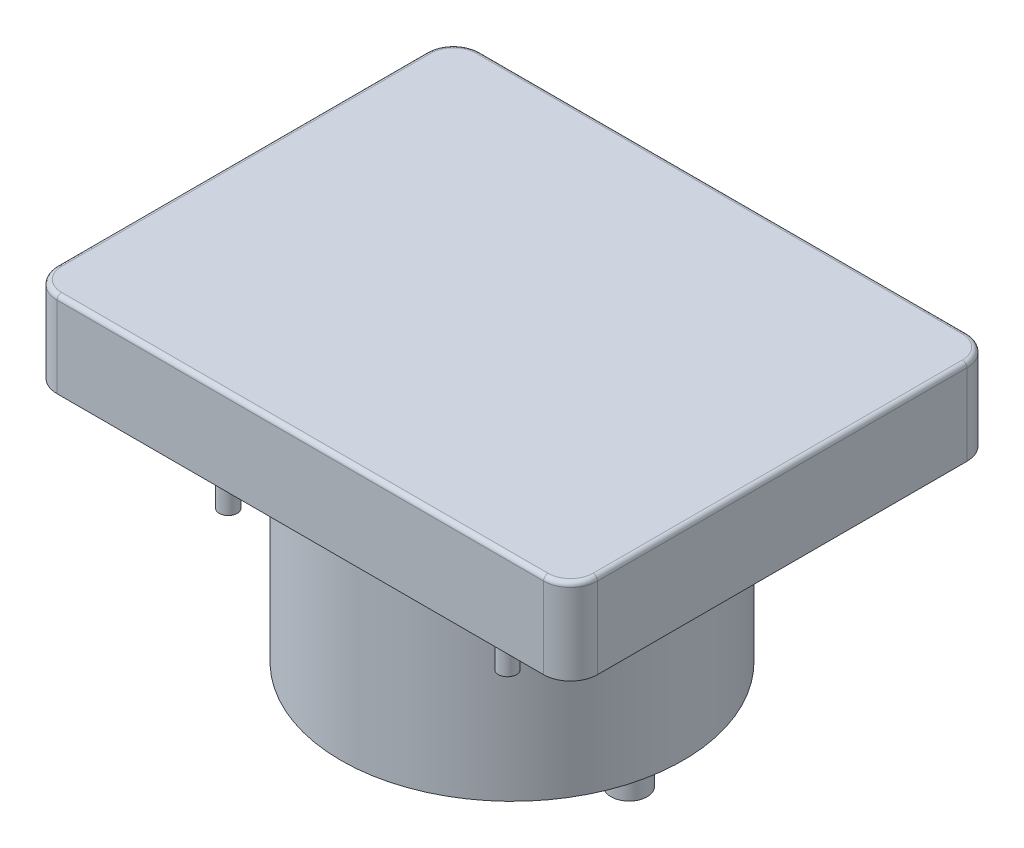
ISO-10303-21;
HEADER;
FILE_DESCRIPTION(('STEP AP214'),'2;1');
FILE_NAME('part.step','',(''),(''),'','','');
FILE_SCHEMA(('AUTOMOTIVE_DESIGN { 1 0 10303 214 1 1 1 1 }'));
ENDSEC;
DATA;
#1=APPLICATION_CONTEXT('core data for automotive mechanical design processes');
#2=APPLICATION_PROTOCOL_DEFINITION('international standard','automotive_design',2000,#1);
#3=PRODUCT_CONTEXT('',#1,'mechanical');
#4=PRODUCT('Part','Part','',(#3));
#5=PRODUCT_RELATED_PRODUCT_CATEGORY('part','',(#4));
#6=PRODUCT_DEFINITION_FORMATION('','',#4);
#7=PRODUCT_DEFINITION_CONTEXT('part definition',#1,'design');
#8=PRODUCT_DEFINITION('design','',#6,#7);
#9=PRODUCT_DEFINITION_SHAPE('','',#8);
#10=(LENGTH_UNIT() NAMED_UNIT(*) SI_UNIT(.MILLI.,.METRE.));
#11=(NAMED_UNIT(*) PLANE_ANGLE_UNIT() SI_UNIT($,.RADIAN.));
#12=(NAMED_UNIT(*) SI_UNIT($,.STERADIAN.) SOLID_ANGLE_UNIT());
#13=UNCERTAINTY_MEASURE_WITH_UNIT(LENGTH_MEASURE(1.E-05),#10,'distance_accuracy_value','');
#14=(GEOMETRIC_REPRESENTATION_CONTEXT(3) GLOBAL_UNCERTAINTY_ASSIGNED_CONTEXT((#13)) GLOBAL_UNIT_ASSIGNED_CONTEXT((#10,
#11,#12)) REPRESENTATION_CONTEXT('',''));
#15=CARTESIAN_POINT('',(0.,0.,0.));
#16=DIRECTION('',(0.,0.,1.));
#17=DIRECTION('',(1.,0.,0.));
#18=AXIS2_PLACEMENT_3D('',#15,#16,#17);
#19=CARTESIAN_POINT('',(-30.,9.5,23.5));
#20=DIRECTION('',(-1.,0.,0.));
#21=DIRECTION('',(0.,0.,1.));
#22=AXIS2_PLACEMENT_3D('',#19,#20,#21);
#23=PLANE('',#22);
#24=DIRECTION('',(0.,-1.,0.));
#25=VECTOR('',#24,1.);
#26=CARTESIAN_POINT('',(-30.,9.5,20.5));
#27=LINE('',#26,#25);
#28=CARTESIAN_POINT('',(-30.,0.,20.5));
#29=VERTEX_POINT('',#28);
#30=CARTESIAN_POINT('',(-30.,9.,20.5));
#31=VERTEX_POINT('',#30);
#32=EDGE_CURVE('E143',#29,#31,#27,.F.);
#33=ORIENTED_EDGE('',*,*,#32,.T.);
#34=DIRECTION('',(0.,0.,-1.));
#35=VECTOR('',#34,1.);
#36=CARTESIAN_POINT('',(-30.,9.,-20.5));
#37=LINE('',#36,#35);
#38=CARTESIAN_POINT('',(-30.,9.,-20.5));
#39=VERTEX_POINT('',#38);
#40=EDGE_CURVE('E218',#31,#39,#37,.T.);
#41=ORIENTED_EDGE('',*,*,#40,.T.);
#42=DIRECTION('',(0.,-1.,0.));
#43=VECTOR('',#42,1.);
#44=CARTESIAN_POINT('',(-30.,9.5,-20.5));
#45=LINE('',#44,#43);
#46=CARTESIAN_POINT('',(-30.,0.,-20.5));
#47=VERTEX_POINT('',#46);
#48=EDGE_CURVE('E147',#39,#47,#45,.T.);
#49=ORIENTED_EDGE('',*,*,#48,.T.);
#50=DIRECTION('',(0.,0.,-1.));
#51=VECTOR('',#50,1.);
#52=CARTESIAN_POINT('',(-30.,0.,23.5));
#53=LINE('',#52,#51);
#54=EDGE_CURVE('E274',#29,#47,#53,.T.);
#55=ORIENTED_EDGE('',*,*,#54,.F.);
#56=EDGE_LOOP('',(#33,#41,#49,#55));
#57=FACE_BOUND('',#56,.T.);
#58=ADVANCED_FACE('F34',(#57),#23,.T.);
#59=CARTESIAN_POINT('',(-30.,9.5,23.5));
#60=DIRECTION('',(0.,0.,-1.));
#61=DIRECTION('',(-1.,0.,0.));
#62=AXIS2_PLACEMENT_3D('',#59,#60,#61);
#63=PLANE('',#62);
#64=DIRECTION('',(0.,-1.,0.));
#65=VECTOR('',#64,1.);
#66=CARTESIAN_POINT('',(27.,9.5,23.5));
#67=LINE('',#66,#65);
#68=CARTESIAN_POINT('',(27.,0.,23.5));
#69=VERTEX_POINT('',#68);
#70=CARTESIAN_POINT('',(27.,9.,23.5));
#71=VERTEX_POINT('',#70);
#72=EDGE_CURVE('E137',#69,#71,#67,.F.);
#73=ORIENTED_EDGE('',*,*,#72,.T.);
#74=DIRECTION('',(1.,0.,0.));
#75=VECTOR('',#74,1.);
#76=CARTESIAN_POINT('',(-30.,9.,23.5));
#77=LINE('',#76,#75);
#78=CARTESIAN_POINT('',(-27.,9.,23.5));
#79=VERTEX_POINT('',#78);
#80=EDGE_CURVE('E133',#71,#79,#77,.F.);
#81=ORIENTED_EDGE('',*,*,#80,.T.);
#82=DIRECTION('',(0.,-1.,0.));
#83=VECTOR('',#82,1.);
#84=CARTESIAN_POINT('',(-27.,0.,23.5));
#85=LINE('',#84,#83);
#86=CARTESIAN_POINT('',(-27.,0.,23.5));
#87=VERTEX_POINT('',#86);
#88=EDGE_CURVE('E125',#79,#87,#85,.T.);
#89=ORIENTED_EDGE('',*,*,#88,.T.);
#90=DIRECTION('',(1.,0.,0.));
#91=VECTOR('',#90,1.);
#92=CARTESIAN_POINT('',(-30.,0.,23.5));
#93=LINE('',#92,#91);
#94=EDGE_CURVE('E130',#87,#69,#93,.T.);
#95=ORIENTED_EDGE('',*,*,#94,.T.);
#96=EDGE_LOOP('',(#73,#81,#89,#95));
#97=FACE_BOUND('',#96,.T.);
#98=ADVANCED_FACE('F128',(#97),#63,.F.);
#99=CARTESIAN_POINT('',(30.,9.5,23.5));
#100=DIRECTION('',(-1.,0.,0.));
#101=DIRECTION('',(0.,0.,1.));
#102=AXIS2_PLACEMENT_3D('',#99,#100,#101);
#103=PLANE('',#102);
#104=DIRECTION('',(0.,-1.,0.));
#105=VECTOR('',#104,1.);
#106=CARTESIAN_POINT('',(30.,9.5,-20.5));
#107=LINE('',#106,#105);
#108=CARTESIAN_POINT('',(30.,0.,-20.5));
#109=VERTEX_POINT('',#108);
#110=CARTESIAN_POINT('',(30.,9.,-20.5));
#111=VERTEX_POINT('',#110);
#112=EDGE_CURVE('E187',#109,#111,#107,.F.);
#113=ORIENTED_EDGE('',*,*,#112,.T.);
#114=DIRECTION('',(0.,0.,-1.));
#115=VECTOR('',#114,1.);
#116=CARTESIAN_POINT('',(30.,9.,23.5));
#117=LINE('',#116,#115);
#118=CARTESIAN_POINT('',(30.,9.,20.5));
#119=VERTEX_POINT('',#118);
#120=EDGE_CURVE('E11',#111,#119,#117,.F.);
#121=ORIENTED_EDGE('',*,*,#120,.T.);
#122=DIRECTION('',(0.,-1.,0.));
#123=VECTOR('',#122,1.);
#124=CARTESIAN_POINT('',(30.,9.5,20.5));
#125=LINE('',#124,#123);
#126=CARTESIAN_POINT('',(30.,0.,20.5));
#127=VERTEX_POINT('',#126);
#128=EDGE_CURVE('E189',#119,#127,#125,.T.);
#129=ORIENTED_EDGE('',*,*,#128,.T.);
#130=DIRECTION('',(0.,0.,-1.));
#131=VECTOR('',#130,1.);
#132=CARTESIAN_POINT('',(30.,0.,23.5));
#133=LINE('',#132,#131);
#134=EDGE_CURVE('E154',#127,#109,#133,.T.);
#135=ORIENTED_EDGE('',*,*,#134,.T.);
#136=EDGE_LOOP('',(#113,#121,#129,#135));
#137=FACE_BOUND('',#136,.T.);
#138=ADVANCED_FACE('F300',(#137),#103,.F.);
#139=CARTESIAN_POINT('',(-30.,9.5,-23.5));
#140=DIRECTION('',(0.,0.,-1.));
#141=DIRECTION('',(-1.,0.,0.));
#142=AXIS2_PLACEMENT_3D('',#139,#140,#141);
#143=PLANE('',#142);
#144=DIRECTION('',(0.,-1.,0.));
#145=VECTOR('',#144,1.);
#146=CARTESIAN_POINT('',(-27.,9.5,-23.5));
#147=LINE('',#146,#145);
#148=CARTESIAN_POINT('',(-27.,0.,-23.5));
#149=VERTEX_POINT('',#148);
#150=CARTESIAN_POINT('',(-27.,9.,-23.5));
#151=VERTEX_POINT('',#150);
#152=EDGE_CURVE('E193',#149,#151,#147,.F.);
#153=ORIENTED_EDGE('',*,*,#152,.T.);
#154=DIRECTION('',(1.,0.,0.));
#155=VECTOR('',#154,1.);
#156=CARTESIAN_POINT('',(27.,9.,-23.5));
#157=LINE('',#156,#155);
#158=CARTESIAN_POINT('',(27.,9.,-23.5));
#159=VERTEX_POINT('',#158);
#160=EDGE_CURVE('E58',#151,#159,#157,.T.);
#161=ORIENTED_EDGE('',*,*,#160,.T.);
#162=DIRECTION('',(0.,-1.,0.));
#163=VECTOR('',#162,1.);
#164=CARTESIAN_POINT('',(27.,0.,-23.5));
#165=LINE('',#164,#163);
#166=CARTESIAN_POINT('',(27.,0.,-23.5));
#167=VERTEX_POINT('',#166);
#168=EDGE_CURVE('E191',#159,#167,#165,.T.);
#169=ORIENTED_EDGE('',*,*,#168,.T.);
#170=DIRECTION('',(1.,0.,0.));
#171=VECTOR('',#170,1.);
#172=CARTESIAN_POINT('',(-30.,0.,-23.5));
#173=LINE('',#172,#171);
#174=EDGE_CURVE('E160',#149,#167,#173,.T.);
#175=ORIENTED_EDGE('',*,*,#174,.F.);
#176=EDGE_LOOP('',(#153,#161,#169,#175));
#177=FACE_BOUND('',#176,.T.);
#178=ADVANCED_FACE('F280',(#177),#143,.T.);
#179=CARTESIAN_POINT('',(0.,9.5,0.));
#180=DIRECTION('',(0.,-1.,0.));
#181=DIRECTION('',(0.,0.,-1.));
#182=AXIS2_PLACEMENT_3D('',#179,#180,#181);
#183=PLANE('',#182);
#184=DIRECTION('',(1.,0.,0.));
#185=VECTOR('',#184,1.);
#186=CARTESIAN_POINT('',(0.,9.5,23.));
#187=LINE('',#186,#185);
#188=CARTESIAN_POINT('',(-27.,9.5,23.));
#189=VERTEX_POINT('',#188);
#190=CARTESIAN_POINT('',(27.,9.5,23.));
#191=VERTEX_POINT('',#190);
#192=EDGE_CURVE('E207',#189,#191,#187,.T.);
#193=ORIENTED_EDGE('',*,*,#192,.T.);
#194=CARTESIAN_POINT('',(27.,9.5,20.5));
#195=DIRECTION('',(0.,-1.,0.));
#196=DIRECTION('',(0.,0.,-1.));
#197=AXIS2_PLACEMENT_3D('',#194,#195,#196);
#198=CIRCLE('',#197,2.5);
#199=CARTESIAN_POINT('',(29.5,9.5,20.5));
#200=VERTEX_POINT('',#199);
#201=EDGE_CURVE('E209',#191,#200,#198,.F.);
#202=ORIENTED_EDGE('',*,*,#201,.T.);
#203=DIRECTION('',(0.,0.,-1.));
#204=VECTOR('',#203,1.);
#205=CARTESIAN_POINT('',(29.5,9.5,0.));
#206=LINE('',#205,#204);
#207=CARTESIAN_POINT('',(29.5,9.5,-20.5));
#208=VERTEX_POINT('',#207);
#209=EDGE_CURVE('E195',#200,#208,#206,.T.);
#210=ORIENTED_EDGE('',*,*,#209,.T.);
#211=CARTESIAN_POINT('',(27.,9.5,-20.5));
#212=DIRECTION('',(0.,-1.,0.));
#213=DIRECTION('',(0.,0.,-1.));
#214=AXIS2_PLACEMENT_3D('',#211,#212,#213);
#215=CIRCLE('',#214,2.5);
#216=CARTESIAN_POINT('',(27.,9.5,-23.));
#217=VERTEX_POINT('',#216);
#218=EDGE_CURVE('E197',#208,#217,#215,.F.);
#219=ORIENTED_EDGE('',*,*,#218,.T.);
#220=DIRECTION('',(1.,0.,0.));
#221=VECTOR('',#220,1.);
#222=CARTESIAN_POINT('',(-27.,9.5,-23.));
#223=LINE('',#222,#221);
#224=CARTESIAN_POINT('',(-27.,9.5,-23.));
#225=VERTEX_POINT('',#224);
#226=EDGE_CURVE('E199',#217,#225,#223,.F.);
#227=ORIENTED_EDGE('',*,*,#226,.T.);
#228=CARTESIAN_POINT('',(-27.,9.5,-20.5));
#229=DIRECTION('',(0.,-1.,0.));
#230=DIRECTION('',(0.,0.,-1.));
#231=AXIS2_PLACEMENT_3D('',#228,#229,#230);
#232=CIRCLE('',#231,2.5);
#233=CARTESIAN_POINT('',(-29.5,9.5,-20.5));
#234=VERTEX_POINT('',#233);
#235=EDGE_CURVE('E201',#225,#234,#232,.F.);
#236=ORIENTED_EDGE('',*,*,#235,.T.);
#237=DIRECTION('',(0.,0.,-1.));
#238=VECTOR('',#237,1.);
#239=CARTESIAN_POINT('',(-29.5,9.5,20.5));
#240=LINE('',#239,#238);
#241=CARTESIAN_POINT('',(-29.5,9.5,20.5));
#242=VERTEX_POINT('',#241);
#243=EDGE_CURVE('E203',#234,#242,#240,.F.);
#244=ORIENTED_EDGE('',*,*,#243,.T.);
#245=CARTESIAN_POINT('',(-27.,9.5,20.5));
#246=DIRECTION('',(0.,-1.,0.));
#247=DIRECTION('',(0.,0.,-1.));
#248=AXIS2_PLACEMENT_3D('',#245,#246,#247);
#249=CIRCLE('',#248,2.5);
#250=EDGE_CURVE('E205',#242,#189,#249,.F.);
#251=ORIENTED_EDGE('',*,*,#250,.T.);
#252=EDGE_LOOP('',(#193,#202,#210,#219,#227,#236,#244,#251));
#253=FACE_BOUND('',#252,.T.);
#254=ADVANCED_FACE('F319',(#253),#183,.F.);
#255=CARTESIAN_POINT('',(0.,0.,0.));
#256=DIRECTION('',(0.,-1.,0.));
#257=DIRECTION('',(0.,0.,-1.));
#258=AXIS2_PLACEMENT_3D('',#255,#256,#257);
#259=PLANE('',#258);
#260=CARTESIAN_POINT('',(0.,0.,0.));
#261=DIRECTION('',(0.,-1.,0.));
#262=DIRECTION('',(0.,0.,-1.));
#263=AXIS2_PLACEMENT_3D('',#260,#261,#262);
#264=CIRCLE('',#263,19.);
#265=CARTESIAN_POINT('',(0.,0.,-19.));
#266=VERTEX_POINT('',#265);
#267=EDGE_CURVE('E172',#266,#266,#264,.T.);
#268=ORIENTED_EDGE('',*,*,#267,.F.);
#269=EDGE_LOOP('',(#268));
#270=FACE_BOUND('',#269,.T.);
#271=CARTESIAN_POINT('',(-15.5,0.,-16.));
#272=DIRECTION('',(0.,-1.,0.));
#273=DIRECTION('',(0.,0.,-1.));
#274=AXIS2_PLACEMENT_3D('',#271,#272,#273);
#275=CIRCLE('',#274,1.);
#276=CARTESIAN_POINT('',(-15.5,0.,-17.));
#277=VERTEX_POINT('',#276);
#278=EDGE_CURVE('E169',#277,#277,#275,.T.);
#279=ORIENTED_EDGE('',*,*,#278,.F.);
#280=EDGE_LOOP('',(#279));
#281=FACE_BOUND('',#280,.T.);
#282=CARTESIAN_POINT('',(-15.5,0.,16.));
#283=DIRECTION('',(0.,-1.,0.));
#284=DIRECTION('',(0.,0.,-1.));
#285=AXIS2_PLACEMENT_3D('',#282,#283,#284);
#286=CIRCLE('',#285,1.);
#287=CARTESIAN_POINT('',(-15.5,0.,15.));
#288=VERTEX_POINT('',#287);
#289=EDGE_CURVE('E166',#288,#288,#286,.T.);
#290=ORIENTED_EDGE('',*,*,#289,.F.);
#291=EDGE_LOOP('',(#290));
#292=FACE_BOUND('',#291,.T.);
#293=CARTESIAN_POINT('',(15.5,0.,16.));
#294=DIRECTION('',(0.,-1.,0.));
#295=DIRECTION('',(0.,0.,-1.));
#296=AXIS2_PLACEMENT_3D('',#293,#294,#295);
#297=CIRCLE('',#296,1.);
#298=CARTESIAN_POINT('',(15.5,0.,15.));
#299=VERTEX_POINT('',#298);
#300=EDGE_CURVE('E157',#299,#299,#297,.T.);
#301=ORIENTED_EDGE('',*,*,#300,.F.);
#302=EDGE_LOOP('',(#301));
#303=FACE_BOUND('',#302,.T.);
#304=CARTESIAN_POINT('',(15.5,0.,-16.));
#305=DIRECTION('',(0.,-1.,0.));
#306=DIRECTION('',(0.,0.,-1.));
#307=AXIS2_PLACEMENT_3D('',#304,#305,#306);
#308=CIRCLE('',#307,1.);
#309=CARTESIAN_POINT('',(15.5,0.,-17.));
#310=VERTEX_POINT('',#309);
#311=EDGE_CURVE('E153',#310,#310,#308,.T.);
#312=ORIENTED_EDGE('',*,*,#311,.F.);
#313=EDGE_LOOP('',(#312));
#314=FACE_BOUND('',#313,.T.);
#315=ORIENTED_EDGE('',*,*,#94,.F.);
#316=CARTESIAN_POINT('',(-27.,0.,20.5));
#317=DIRECTION('',(0.,-1.,0.));
#318=DIRECTION('',(0.,0.,-1.));
#319=AXIS2_PLACEMENT_3D('',#316,#317,#318);
#320=CIRCLE('',#319,3.);
#321=EDGE_CURVE('E140',#87,#29,#320,.T.);
#322=ORIENTED_EDGE('',*,*,#321,.T.);
#323=ORIENTED_EDGE('',*,*,#54,.T.);
#324=CARTESIAN_POINT('',(-27.,0.,-20.5));
#325=DIRECTION('',(0.,-1.,0.));
#326=DIRECTION('',(0.,0.,-1.));
#327=AXIS2_PLACEMENT_3D('',#324,#325,#326);
#328=CIRCLE('',#327,3.);
#329=EDGE_CURVE('E182',#47,#149,#328,.T.);
#330=ORIENTED_EDGE('',*,*,#329,.T.);
#331=ORIENTED_EDGE('',*,*,#174,.T.);
#332=CARTESIAN_POINT('',(27.,0.,-20.5));
#333=DIRECTION('',(0.,-1.,0.));
#334=DIRECTION('',(0.,0.,-1.));
#335=AXIS2_PLACEMENT_3D('',#332,#333,#334);
#336=CIRCLE('',#335,3.);
#337=EDGE_CURVE('E136',#167,#109,#336,.T.);
#338=ORIENTED_EDGE('',*,*,#337,.T.);
#339=ORIENTED_EDGE('',*,*,#134,.F.);
#340=CARTESIAN_POINT('',(27.,0.,20.5));
#341=DIRECTION('',(0.,-1.,0.));
#342=DIRECTION('',(0.,0.,-1.));
#343=AXIS2_PLACEMENT_3D('',#340,#341,#342);
#344=CIRCLE('',#343,3.);
#345=EDGE_CURVE('E148',#127,#69,#344,.T.);
#346=ORIENTED_EDGE('',*,*,#345,.T.);
#347=EDGE_LOOP('',(#315,#322,#323,#330,#331,#338,#339,#346));
#348=FACE_BOUND('',#347,.T.);
#349=ADVANCED_FACE('F150',(#270,#281,#292,#303,#314,#348),#259,.T.);
#350=CARTESIAN_POINT('',(15.5,-9.,-16.));
#351=DIRECTION('',(0.,1.,0.));
#352=DIRECTION('',(0.,0.,1.));
#353=AXIS2_PLACEMENT_3D('',#350,#351,#352);
#354=CYLINDRICAL_SURFACE('',#353,1.);
#355=CARTESIAN_POINT('',(15.5,-9.,-16.));
#356=DIRECTION('',(0.,1.,0.));
#357=DIRECTION('',(0.,0.,1.));
#358=AXIS2_PLACEMENT_3D('',#355,#356,#357);
#359=CIRCLE('',#358,1.);
#360=CARTESIAN_POINT('',(15.5,-9.,-15.));
#361=VERTEX_POINT('',#360);
#362=EDGE_CURVE('E271',#361,#361,#359,.T.);
#363=ORIENTED_EDGE('',*,*,#362,.T.);
#364=EDGE_LOOP('',(#363));
#365=FACE_BOUND('',#364,.T.);
#366=ORIENTED_EDGE('',*,*,#311,.T.);
#367=EDGE_LOOP('',(#366));
#368=FACE_BOUND('',#367,.T.);
#369=ADVANCED_FACE('F326',(#365,#368),#354,.T.);
#370=CARTESIAN_POINT('',(15.5,-9.,-16.));
#371=DIRECTION('',(0.,1.,0.));
#372=DIRECTION('',(0.,0.,1.));
#373=AXIS2_PLACEMENT_3D('',#370,#371,#372);
#374=PLANE('',#373);
#375=ORIENTED_EDGE('',*,*,#362,.F.);
#376=EDGE_LOOP('',(#375));
#377=FACE_BOUND('',#376,.T.);
#378=ADVANCED_FACE('F476',(#377),#374,.F.);
#379=CARTESIAN_POINT('',(15.5,-9.,16.));
#380=DIRECTION('',(0.,1.,0.));
#381=DIRECTION('',(0.,0.,1.));
#382=AXIS2_PLACEMENT_3D('',#379,#380,#381);
#383=CYLINDRICAL_SURFACE('',#382,1.);
#384=CARTESIAN_POINT('',(15.5,-9.,16.));
#385=DIRECTION('',(0.,1.,0.));
#386=DIRECTION('',(0.,0.,1.));
#387=AXIS2_PLACEMENT_3D('',#384,#385,#386);
#388=CIRCLE('',#387,1.);
#389=CARTESIAN_POINT('',(15.5,-9.,17.));
#390=VERTEX_POINT('',#389);
#391=EDGE_CURVE('E268',#390,#390,#388,.T.);
#392=ORIENTED_EDGE('',*,*,#391,.T.);
#393=EDGE_LOOP('',(#392));
#394=FACE_BOUND('',#393,.T.);
#395=ORIENTED_EDGE('',*,*,#300,.T.);
#396=EDGE_LOOP('',(#395));
#397=FACE_BOUND('',#396,.T.);
#398=ADVANCED_FACE('F468',(#394,#397),#383,.T.);
#399=CARTESIAN_POINT('',(15.5,-9.,16.));
#400=DIRECTION('',(0.,1.,0.));
#401=DIRECTION('',(0.,0.,1.));
#402=AXIS2_PLACEMENT_3D('',#399,#400,#401);
#403=PLANE('',#402);
#404=ORIENTED_EDGE('',*,*,#391,.F.);
#405=EDGE_LOOP('',(#404));
#406=FACE_BOUND('',#405,.T.);
#407=ADVANCED_FACE('F460',(#406),#403,.F.);
#408=CARTESIAN_POINT('',(-15.5,-9.,16.));
#409=DIRECTION('',(0.,1.,0.));
#410=DIRECTION('',(0.,0.,1.));
#411=AXIS2_PLACEMENT_3D('',#408,#409,#410);
#412=CYLINDRICAL_SURFACE('',#411,1.);
#413=CARTESIAN_POINT('',(-15.5,-9.,16.));
#414=DIRECTION('',(0.,1.,0.));
#415=DIRECTION('',(0.,0.,1.));
#416=AXIS2_PLACEMENT_3D('',#413,#414,#415);
#417=CIRCLE('',#416,1.);
#418=CARTESIAN_POINT('',(-15.5,-9.,17.));
#419=VERTEX_POINT('',#418);
#420=EDGE_CURVE('E265',#419,#419,#417,.T.);
#421=ORIENTED_EDGE('',*,*,#420,.T.);
#422=EDGE_LOOP('',(#421));
#423=FACE_BOUND('',#422,.T.);
#424=ORIENTED_EDGE('',*,*,#289,.T.);
#425=EDGE_LOOP('',(#424));
#426=FACE_BOUND('',#425,.T.);
#427=ADVANCED_FACE('F452',(#423,#426),#412,.T.);
#428=CARTESIAN_POINT('',(-15.5,-9.,16.));
#429=DIRECTION('',(0.,1.,0.));
#430=DIRECTION('',(0.,0.,1.));
#431=AXIS2_PLACEMENT_3D('',#428,#429,#430);
#432=PLANE('',#431);
#433=ORIENTED_EDGE('',*,*,#420,.F.);
#434=EDGE_LOOP('',(#433));
#435=FACE_BOUND('',#434,.T.);
#436=ADVANCED_FACE('F444',(#435),#432,.F.);
#437=CARTESIAN_POINT('',(-15.5,-9.,-16.));
#438=DIRECTION('',(0.,1.,0.));
#439=DIRECTION('',(0.,0.,1.));
#440=AXIS2_PLACEMENT_3D('',#437,#438,#439);
#441=CYLINDRICAL_SURFACE('',#440,1.);
#442=CARTESIAN_POINT('',(-15.5,-9.,-16.));
#443=DIRECTION('',(0.,1.,0.));
#444=DIRECTION('',(0.,0.,1.));
#445=AXIS2_PLACEMENT_3D('',#442,#443,#444);
#446=CIRCLE('',#445,1.);
#447=CARTESIAN_POINT('',(-15.5,-9.,-15.));
#448=VERTEX_POINT('',#447);
#449=EDGE_CURVE('E262',#448,#448,#446,.T.);
#450=ORIENTED_EDGE('',*,*,#449,.T.);
#451=EDGE_LOOP('',(#450));
#452=FACE_BOUND('',#451,.T.);
#453=ORIENTED_EDGE('',*,*,#278,.T.);
#454=EDGE_LOOP('',(#453));
#455=FACE_BOUND('',#454,.T.);
#456=ADVANCED_FACE('F436',(#452,#455),#441,.T.);
#457=CARTESIAN_POINT('',(-15.5,-9.,-16.));
#458=DIRECTION('',(0.,1.,0.));
#459=DIRECTION('',(0.,0.,1.));
#460=AXIS2_PLACEMENT_3D('',#457,#458,#459);
#461=PLANE('',#460);
#462=ORIENTED_EDGE('',*,*,#449,.F.);
#463=EDGE_LOOP('',(#462));
#464=FACE_BOUND('',#463,.T.);
#465=ADVANCED_FACE('F430',(#464),#461,.F.);
#466=CARTESIAN_POINT('',(0.,-24.,0.));
#467=DIRECTION('',(0.,1.,0.));
#468=DIRECTION('',(0.,0.,1.));
#469=AXIS2_PLACEMENT_3D('',#466,#467,#468);
#470=CYLINDRICAL_SURFACE('',#469,19.);
#471=CARTESIAN_POINT('',(0.,-24.,0.));
#472=DIRECTION('',(0.,1.,0.));
#473=DIRECTION('',(0.,0.,1.));
#474=AXIS2_PLACEMENT_3D('',#471,#472,#473);
#475=CIRCLE('',#474,19.);
#476=CARTESIAN_POINT('',(0.,-24.,19.));
#477=VERTEX_POINT('',#476);
#478=EDGE_CURVE('E177',#477,#477,#475,.T.);
#479=ORIENTED_EDGE('',*,*,#478,.T.);
#480=EDGE_LOOP('',(#479));
#481=FACE_BOUND('',#480,.T.);
#482=ORIENTED_EDGE('',*,*,#267,.T.);
#483=EDGE_LOOP('',(#482));
#484=FACE_BOUND('',#483,.T.);
#485=ADVANCED_FACE('F423',(#481,#484),#470,.T.);
#486=CARTESIAN_POINT('',(0.,-24.,0.));
#487=DIRECTION('',(0.,1.,0.));
#488=DIRECTION('',(0.,0.,1.));
#489=AXIS2_PLACEMENT_3D('',#486,#487,#488);
#490=PLANE('',#489);
#491=CARTESIAN_POINT('',(13.,-24.,0.));
#492=DIRECTION('',(0.,1.,0.));
#493=DIRECTION('',(0.,0.,1.));
#494=AXIS2_PLACEMENT_3D('',#491,#492,#493);
#495=CIRCLE('',#494,2.);
#496=CARTESIAN_POINT('',(13.,-24.,2.));
#497=VERTEX_POINT('',#496);
#498=EDGE_CURVE('E176',#497,#497,#495,.F.);
#499=ORIENTED_EDGE('',*,*,#498,.F.);
#500=EDGE_LOOP('',(#499));
#501=FACE_BOUND('',#500,.T.);
#502=CARTESIAN_POINT('',(-13.,-24.,0.));
#503=DIRECTION('',(0.,1.,0.));
#504=DIRECTION('',(0.,0.,1.));
#505=AXIS2_PLACEMENT_3D('',#502,#503,#504);
#506=CIRCLE('',#505,2.);
#507=CARTESIAN_POINT('',(-13.,-24.,2.));
#508=VERTEX_POINT('',#507);
#509=EDGE_CURVE('E173',#508,#508,#506,.F.);
#510=ORIENTED_EDGE('',*,*,#509,.F.);
#511=EDGE_LOOP('',(#510));
#512=FACE_BOUND('',#511,.T.);
#513=ORIENTED_EDGE('',*,*,#478,.F.);
#514=EDGE_LOOP('',(#513));
#515=FACE_BOUND('',#514,.T.);
#516=ADVANCED_FACE('F415',(#501,#512,#515),#490,.F.);
#517=CARTESIAN_POINT('',(13.,-29.5,0.));
#518=DIRECTION('',(0.,1.,0.));
#519=DIRECTION('',(0.,0.,1.));
#520=AXIS2_PLACEMENT_3D('',#517,#518,#519);
#521=PLANE('',#520);
#522=CARTESIAN_POINT('',(13.,-29.5,0.));
#523=DIRECTION('',(0.,1.,0.));
#524=DIRECTION('',(0.,0.,1.));
#525=AXIS2_PLACEMENT_3D('',#522,#523,#524);
#526=CIRCLE('',#525,2.);
#527=CARTESIAN_POINT('',(13.,-29.5,2.));
#528=VERTEX_POINT('',#527);
#529=EDGE_CURVE('E259',#528,#528,#526,.T.);
#530=ORIENTED_EDGE('',*,*,#529,.F.);
#531=EDGE_LOOP('',(#530));
#532=FACE_BOUND('',#531,.T.);
#533=ADVANCED_FACE('F407',(#532),#521,.F.);
#534=CARTESIAN_POINT('',(13.,-29.5,0.));
#535=DIRECTION('',(0.,1.,0.));
#536=DIRECTION('',(0.,0.,1.));
#537=AXIS2_PLACEMENT_3D('',#534,#535,#536);
#538=CYLINDRICAL_SURFACE('',#537,2.);
#539=ORIENTED_EDGE('',*,*,#529,.T.);
#540=EDGE_LOOP('',(#539));
#541=FACE_BOUND('',#540,.T.);
#542=ORIENTED_EDGE('',*,*,#498,.T.);
#543=EDGE_LOOP('',(#542));
#544=FACE_BOUND('',#543,.T.);
#545=ADVANCED_FACE('F398',(#541,#544),#538,.T.);
#546=CARTESIAN_POINT('',(-13.,-29.5,0.));
#547=DIRECTION('',(0.,1.,0.));
#548=DIRECTION('',(0.,0.,1.));
#549=AXIS2_PLACEMENT_3D('',#546,#547,#548);
#550=PLANE('',#549);
#551=CARTESIAN_POINT('',(-13.,-29.5,0.));
#552=DIRECTION('',(0.,1.,0.));
#553=DIRECTION('',(0.,0.,1.));
#554=AXIS2_PLACEMENT_3D('',#551,#552,#553);
#555=CIRCLE('',#554,2.);
#556=CARTESIAN_POINT('',(-13.,-29.5,2.));
#557=VERTEX_POINT('',#556);
#558=EDGE_CURVE('E256',#557,#557,#555,.T.);
#559=ORIENTED_EDGE('',*,*,#558,.F.);
#560=EDGE_LOOP('',(#559));
#561=FACE_BOUND('',#560,.T.);
#562=ADVANCED_FACE('F388',(#561),#550,.F.);
#563=CARTESIAN_POINT('',(-13.,-29.5,0.));
#564=DIRECTION('',(0.,1.,0.));
#565=DIRECTION('',(0.,0.,1.));
#566=AXIS2_PLACEMENT_3D('',#563,#564,#565);
#567=CYLINDRICAL_SURFACE('',#566,2.);
#568=ORIENTED_EDGE('',*,*,#558,.T.);
#569=EDGE_LOOP('',(#568));
#570=FACE_BOUND('',#569,.T.);
#571=ORIENTED_EDGE('',*,*,#509,.T.);
#572=EDGE_LOOP('',(#571));
#573=FACE_BOUND('',#572,.T.);
#574=ADVANCED_FACE('F341',(#570,#573),#567,.T.);
#575=CARTESIAN_POINT('',(-27.,9.5,20.5));
#576=DIRECTION('',(0.,1.,0.));
#577=DIRECTION('',(0.,0.,1.));
#578=AXIS2_PLACEMENT_3D('',#575,#576,#577);
#579=CYLINDRICAL_SURFACE('',#578,3.);
#580=ORIENTED_EDGE('',*,*,#88,.F.);
#581=CARTESIAN_POINT('',(-27.,9.,20.5));
#582=DIRECTION('',(0.,-1.,0.));
#583=DIRECTION('',(0.,0.,-1.));
#584=AXIS2_PLACEMENT_3D('',#581,#582,#583);
#585=CIRCLE('',#584,3.);
#586=EDGE_CURVE('E216',#79,#31,#585,.T.);
#587=ORIENTED_EDGE('',*,*,#586,.T.);
#588=ORIENTED_EDGE('',*,*,#32,.F.);
#589=ORIENTED_EDGE('',*,*,#321,.F.);
#590=EDGE_LOOP('',(#580,#587,#588,#589));
#591=FACE_BOUND('',#590,.T.);
#592=ADVANCED_FACE('F141',(#591),#579,.T.);
#593=CARTESIAN_POINT('',(27.,9.5,20.5));
#594=DIRECTION('',(0.,-1.,0.));
#595=DIRECTION('',(0.,0.,-1.));
#596=AXIS2_PLACEMENT_3D('',#593,#594,#595);
#597=CYLINDRICAL_SURFACE('',#596,3.);
#598=ORIENTED_EDGE('',*,*,#128,.F.);
#599=CARTESIAN_POINT('',(27.,9.,20.5));
#600=DIRECTION('',(0.,-1.,0.));
#601=DIRECTION('',(0.,0.,-1.));
#602=AXIS2_PLACEMENT_3D('',#599,#600,#601);
#603=CIRCLE('',#602,3.);
#604=EDGE_CURVE('E212',#119,#71,#603,.T.);
#605=ORIENTED_EDGE('',*,*,#604,.T.);
#606=ORIENTED_EDGE('',*,*,#72,.F.);
#607=ORIENTED_EDGE('',*,*,#345,.F.);
#608=EDGE_LOOP('',(#598,#605,#606,#607));
#609=FACE_BOUND('',#608,.T.);
#610=ADVANCED_FACE('F303',(#609),#597,.T.);
#611=CARTESIAN_POINT('',(-27.,9.5,-20.5));
#612=DIRECTION('',(0.,-1.,0.));
#613=DIRECTION('',(0.,0.,-1.));
#614=AXIS2_PLACEMENT_3D('',#611,#612,#613);
#615=CYLINDRICAL_SURFACE('',#614,3.);
#616=ORIENTED_EDGE('',*,*,#48,.F.);
#617=CARTESIAN_POINT('',(-27.,9.,-20.5));
#618=DIRECTION('',(0.,-1.,0.));
#619=DIRECTION('',(0.,0.,-1.));
#620=AXIS2_PLACEMENT_3D('',#617,#618,#619);
#621=CIRCLE('',#620,3.);
#622=EDGE_CURVE('E220',#39,#151,#621,.T.);
#623=ORIENTED_EDGE('',*,*,#622,.T.);
#624=ORIENTED_EDGE('',*,*,#152,.F.);
#625=ORIENTED_EDGE('',*,*,#329,.F.);
#626=EDGE_LOOP('',(#616,#623,#624,#625));
#627=FACE_BOUND('',#626,.T.);
#628=ADVANCED_FACE('F283',(#627),#615,.T.);
#629=CARTESIAN_POINT('',(27.,9.5,-20.5));
#630=DIRECTION('',(0.,1.,0.));
#631=DIRECTION('',(0.,0.,1.));
#632=AXIS2_PLACEMENT_3D('',#629,#630,#631);
#633=CYLINDRICAL_SURFACE('',#632,3.);
#634=ORIENTED_EDGE('',*,*,#168,.F.);
#635=CARTESIAN_POINT('',(27.,9.,-20.5));
#636=DIRECTION('',(0.,-1.,0.));
#637=DIRECTION('',(0.,0.,-1.));
#638=AXIS2_PLACEMENT_3D('',#635,#636,#637);
#639=CIRCLE('',#638,3.);
#640=EDGE_CURVE('E43',#159,#111,#639,.T.);
#641=ORIENTED_EDGE('',*,*,#640,.T.);
#642=ORIENTED_EDGE('',*,*,#112,.F.);
#643=ORIENTED_EDGE('',*,*,#337,.F.);
#644=EDGE_LOOP('',(#634,#641,#642,#643));
#645=FACE_BOUND('',#644,.T.);
#646=ADVANCED_FACE('F346',(#645),#633,.T.);
#647=CARTESIAN_POINT('',(-27.,9.,-20.5));
#648=DIRECTION('',(0.,-1.,0.));
#649=DIRECTION('',(0.,0.,-1.));
#650=AXIS2_PLACEMENT_3D('',#647,#648,#649);
#651=TOROIDAL_SURFACE('',#650,2.5,0.5);
#652=CARTESIAN_POINT('',(-27.,9.,-23.));
#653=DIRECTION('',(1.,0.,0.));
#654=DIRECTION('',(0.,0.,-1.));
#655=AXIS2_PLACEMENT_3D('',#652,#653,#654);
#656=CIRCLE('',#655,0.5);
#657=EDGE_CURVE('E239',#151,#225,#656,.T.);
#658=ORIENTED_EDGE('',*,*,#657,.F.);
#659=ORIENTED_EDGE('',*,*,#622,.F.);
#660=CARTESIAN_POINT('',(-29.5,9.,-20.5));
#661=DIRECTION('',(0.,0.,1.));
#662=DIRECTION('',(1.,0.,0.));
#663=AXIS2_PLACEMENT_3D('',#660,#661,#662);
#664=CIRCLE('',#663,0.5);
#665=EDGE_CURVE('E38',#234,#39,#664,.T.);
#666=ORIENTED_EDGE('',*,*,#665,.F.);
#667=ORIENTED_EDGE('',*,*,#235,.F.);
#668=EDGE_LOOP('',(#658,#659,#666,#667));
#669=FACE_BOUND('',#668,.T.);
#670=ADVANCED_FACE('F36',(#669),#651,.T.);
#671=CARTESIAN_POINT('',(-29.5,9.,23.5));
#672=DIRECTION('',(0.,0.,1.));
#673=DIRECTION('',(1.,0.,0.));
#674=AXIS2_PLACEMENT_3D('',#671,#672,#673);
#675=CYLINDRICAL_SURFACE('',#674,0.5);
#676=ORIENTED_EDGE('',*,*,#665,.T.);
#677=ORIENTED_EDGE('',*,*,#40,.F.);
#678=CARTESIAN_POINT('',(-29.5,9.,20.5));
#679=DIRECTION('',(0.,0.,1.));
#680=DIRECTION('',(1.,0.,0.));
#681=AXIS2_PLACEMENT_3D('',#678,#679,#680);
#682=CIRCLE('',#681,0.5);
#683=EDGE_CURVE('E237',#242,#31,#682,.T.);
#684=ORIENTED_EDGE('',*,*,#683,.F.);
#685=ORIENTED_EDGE('',*,*,#243,.F.);
#686=EDGE_LOOP('',(#676,#677,#684,#685));
#687=FACE_BOUND('',#686,.T.);
#688=ADVANCED_FACE('F317',(#687),#675,.T.);
#689=CARTESIAN_POINT('',(-30.,9.,-23.));
#690=DIRECTION('',(-1.,0.,0.));
#691=DIRECTION('',(0.,0.,1.));
#692=AXIS2_PLACEMENT_3D('',#689,#690,#691);
#693=CYLINDRICAL_SURFACE('',#692,0.5);
#694=ORIENTED_EDGE('',*,*,#657,.T.);
#695=ORIENTED_EDGE('',*,*,#226,.F.);
#696=CARTESIAN_POINT('',(27.,9.,-23.));
#697=DIRECTION('',(1.,0.,0.));
#698=DIRECTION('',(0.,0.,-1.));
#699=AXIS2_PLACEMENT_3D('',#696,#697,#698);
#700=CIRCLE('',#699,0.5);
#701=EDGE_CURVE('E234',#159,#217,#700,.T.);
#702=ORIENTED_EDGE('',*,*,#701,.F.);
#703=ORIENTED_EDGE('',*,*,#160,.F.);
#704=EDGE_LOOP('',(#694,#695,#702,#703));
#705=FACE_BOUND('',#704,.T.);
#706=ADVANCED_FACE('F288',(#705),#693,.T.);
#707=CARTESIAN_POINT('',(-27.,9.,20.5));
#708=DIRECTION('',(0.,-1.,0.));
#709=DIRECTION('',(0.,0.,-1.));
#710=AXIS2_PLACEMENT_3D('',#707,#708,#709);
#711=TOROIDAL_SURFACE('',#710,2.5,0.5);
#712=ORIENTED_EDGE('',*,*,#683,.T.);
#713=ORIENTED_EDGE('',*,*,#586,.F.);
#714=CARTESIAN_POINT('',(-27.,9.,23.));
#715=DIRECTION('',(1.,0.,0.));
#716=DIRECTION('',(0.,0.,-1.));
#717=AXIS2_PLACEMENT_3D('',#714,#715,#716);
#718=CIRCLE('',#717,0.5);
#719=EDGE_CURVE('E231',#189,#79,#718,.T.);
#720=ORIENTED_EDGE('',*,*,#719,.F.);
#721=ORIENTED_EDGE('',*,*,#250,.F.);
#722=EDGE_LOOP('',(#712,#713,#720,#721));
#723=FACE_BOUND('',#722,.T.);
#724=ADVANCED_FACE('F314',(#723),#711,.T.);
#725=CARTESIAN_POINT('',(27.,9.,-20.5));
#726=DIRECTION('',(0.,-1.,0.));
#727=DIRECTION('',(0.,0.,-1.));
#728=AXIS2_PLACEMENT_3D('',#725,#726,#727);
#729=TOROIDAL_SURFACE('',#728,2.5,0.5);
#730=ORIENTED_EDGE('',*,*,#701,.T.);
#731=ORIENTED_EDGE('',*,*,#218,.F.);
#732=CARTESIAN_POINT('',(29.5,9.,-20.5));
#733=DIRECTION('',(0.,0.,1.));
#734=DIRECTION('',(1.,0.,0.));
#735=AXIS2_PLACEMENT_3D('',#732,#733,#734);
#736=CIRCLE('',#735,0.5);
#737=EDGE_CURVE('E228',#111,#208,#736,.T.);
#738=ORIENTED_EDGE('',*,*,#737,.F.);
#739=ORIENTED_EDGE('',*,*,#640,.F.);
#740=EDGE_LOOP('',(#730,#731,#738,#739));
#741=FACE_BOUND('',#740,.T.);
#742=ADVANCED_FACE('F292',(#741),#729,.T.);
#743=CARTESIAN_POINT('',(0.,9.,23.));
#744=DIRECTION('',(1.,0.,0.));
#745=DIRECTION('',(0.,0.,-1.));
#746=AXIS2_PLACEMENT_3D('',#743,#744,#745);
#747=CYLINDRICAL_SURFACE('',#746,0.5);
#748=ORIENTED_EDGE('',*,*,#719,.T.);
#749=ORIENTED_EDGE('',*,*,#80,.F.);
#750=CARTESIAN_POINT('',(27.,9.,23.));
#751=DIRECTION('',(1.,0.,0.));
#752=DIRECTION('',(0.,0.,-1.));
#753=AXIS2_PLACEMENT_3D('',#750,#751,#752);
#754=CIRCLE('',#753,0.5);
#755=EDGE_CURVE('E226',#191,#71,#754,.T.);
#756=ORIENTED_EDGE('',*,*,#755,.F.);
#757=ORIENTED_EDGE('',*,*,#192,.F.);
#758=EDGE_LOOP('',(#748,#749,#756,#757));
#759=FACE_BOUND('',#758,.T.);
#760=ADVANCED_FACE('F310',(#759),#747,.T.);
#761=CARTESIAN_POINT('',(29.5,9.,0.));
#762=DIRECTION('',(0.,0.,-1.));
#763=DIRECTION('',(-1.,0.,0.));
#764=AXIS2_PLACEMENT_3D('',#761,#762,#763);
#765=CYLINDRICAL_SURFACE('',#764,0.5);
#766=ORIENTED_EDGE('',*,*,#737,.T.);
#767=ORIENTED_EDGE('',*,*,#209,.F.);
#768=CARTESIAN_POINT('',(29.5,9.,20.5));
#769=DIRECTION('',(0.,0.,1.));
#770=DIRECTION('',(1.,0.,0.));
#771=AXIS2_PLACEMENT_3D('',#768,#769,#770);
#772=CIRCLE('',#771,0.5);
#773=EDGE_CURVE('E224',#119,#200,#772,.T.);
#774=ORIENTED_EDGE('',*,*,#773,.F.);
#775=ORIENTED_EDGE('',*,*,#120,.F.);
#776=EDGE_LOOP('',(#766,#767,#774,#775));
#777=FACE_BOUND('',#776,.T.);
#778=ADVANCED_FACE('F297',(#777),#765,.T.);
#779=CARTESIAN_POINT('',(27.,9.,20.5));
#780=DIRECTION('',(0.,-1.,0.));
#781=DIRECTION('',(0.,0.,-1.));
#782=AXIS2_PLACEMENT_3D('',#779,#780,#781);
#783=TOROIDAL_SURFACE('',#782,2.5,0.5);
#784=ORIENTED_EDGE('',*,*,#755,.T.);
#785=ORIENTED_EDGE('',*,*,#604,.F.);
#786=ORIENTED_EDGE('',*,*,#773,.T.);
#787=ORIENTED_EDGE('',*,*,#201,.F.);
#788=EDGE_LOOP('',(#784,#785,#786,#787));
#789=FACE_BOUND('',#788,.T.);
#790=ADVANCED_FACE('F305',(#789),#783,.T.);
#791=CLOSED_SHELL('',(#58,#98,#138,#178,#254,#349,#369,#378,#398,#407,#427,#436,#456,#465,#485,
#516,#533,#545,#562,#574,#592,#610,#628,#646,#670,#688,#706,#724,#742,#760,#778,#790));
#792=MANIFOLD_SOLID_BREP('B2',#791);
#793=ADVANCED_BREP_SHAPE_REPRESENTATION('',(#18,#792),#14);
#794=SHAPE_DEFINITION_REPRESENTATION(#9,#793);
ENDSEC;
END-ISO-10303-21;
